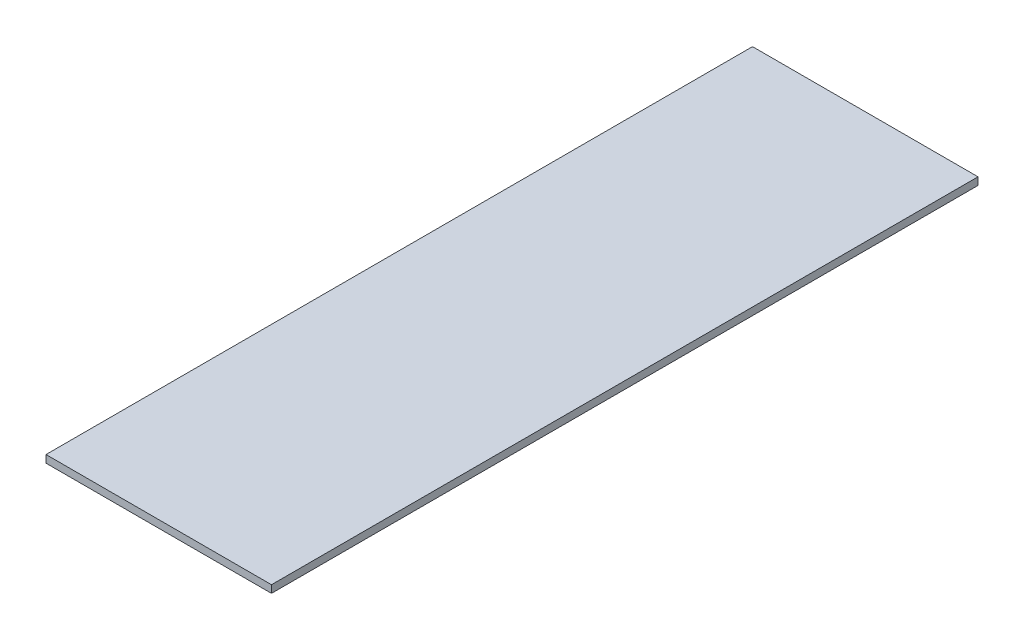
ISO-10303-21;
HEADER;
FILE_DESCRIPTION(('STEP AP214'),'2;1');
FILE_NAME('part.step','',(''),(''),'','','');
FILE_SCHEMA(('AUTOMOTIVE_DESIGN { 1 0 10303 214 1 1 1 1 }'));
ENDSEC;
DATA;
#1=APPLICATION_CONTEXT('core data for automotive mechanical design processes');
#2=APPLICATION_PROTOCOL_DEFINITION('international standard','automotive_design',2000,#1);
#3=PRODUCT_CONTEXT('',#1,'mechanical');
#4=PRODUCT('Part','Part','',(#3));
#5=PRODUCT_RELATED_PRODUCT_CATEGORY('part','',(#4));
#6=PRODUCT_DEFINITION_FORMATION('','',#4);
#7=PRODUCT_DEFINITION_CONTEXT('part definition',#1,'design');
#8=PRODUCT_DEFINITION('design','',#6,#7);
#9=PRODUCT_DEFINITION_SHAPE('','',#8);
#10=(LENGTH_UNIT() NAMED_UNIT(*) SI_UNIT(.MILLI.,.METRE.));
#11=(NAMED_UNIT(*) PLANE_ANGLE_UNIT() SI_UNIT($,.RADIAN.));
#12=(NAMED_UNIT(*) SI_UNIT($,.STERADIAN.) SOLID_ANGLE_UNIT());
#13=UNCERTAINTY_MEASURE_WITH_UNIT(LENGTH_MEASURE(1.E-05),#10,'distance_accuracy_value','');
#14=(GEOMETRIC_REPRESENTATION_CONTEXT(3) GLOBAL_UNCERTAINTY_ASSIGNED_CONTEXT((#13)) GLOBAL_UNIT_ASSIGNED_CONTEXT((#10,
#11,#12)) REPRESENTATION_CONTEXT('',''));
#15=CARTESIAN_POINT('',(0.,0.,0.));
#16=DIRECTION('',(0.,0.,1.));
#17=DIRECTION('',(1.,0.,0.));
#18=AXIS2_PLACEMENT_3D('',#15,#16,#17);
#19=CARTESIAN_POINT('',(21.25,1.52,14.48));
#20=DIRECTION('',(0.,1.,0.));
#21=DIRECTION('',(0.,0.,1.));
#22=AXIS2_PLACEMENT_3D('',#19,#20,#21);
#23=PLANE('',#22);
#24=DIRECTION('',(0.,0.,1.));
#25=VECTOR('',#24,1.);
#26=CARTESIAN_POINT('',(20.5,1.52,12.13));
#27=LINE('',#26,#25);
#28=CARTESIAN_POINT('',(20.5,1.52,12.13));
#29=VERTEX_POINT('',#28);
#30=CARTESIAN_POINT('',(20.5,1.52,16.83));
#31=VERTEX_POINT('',#30);
#32=EDGE_CURVE('E79',#29,#31,#27,.T.);
#33=ORIENTED_EDGE('',*,*,#32,.F.);
#34=DIRECTION('',(-1.,0.,0.));
#35=VECTOR('',#34,1.);
#36=CARTESIAN_POINT('',(22.,1.52,12.13));
#37=LINE('',#36,#35);
#38=CARTESIAN_POINT('',(22.,1.52,12.13));
#39=VERTEX_POINT('',#38);
#40=EDGE_CURVE('E55',#39,#29,#37,.T.);
#41=ORIENTED_EDGE('',*,*,#40,.F.);
#42=DIRECTION('',(0.,0.,-1.));
#43=VECTOR('',#42,1.);
#44=CARTESIAN_POINT('',(22.,1.52,16.83));
#45=LINE('',#44,#43);
#46=CARTESIAN_POINT('',(22.,1.52,16.83));
#47=VERTEX_POINT('',#46);
#48=EDGE_CURVE('E57',#47,#39,#45,.T.);
#49=ORIENTED_EDGE('',*,*,#48,.F.);
#50=DIRECTION('',(1.,0.,0.));
#51=VECTOR('',#50,1.);
#52=CARTESIAN_POINT('',(20.5,1.52,16.83));
#53=LINE('',#52,#51);
#54=EDGE_CURVE('E20',#31,#47,#53,.T.);
#55=ORIENTED_EDGE('',*,*,#54,.F.);
#56=EDGE_LOOP('',(#33,#41,#49,#55));
#57=FACE_BOUND('',#56,.T.);
#58=ADVANCED_FACE('F17',(#57),#23,.F.);
#59=CARTESIAN_POINT('',(20.5,1.52,16.83));
#60=DIRECTION('',(0.,0.,1.));
#61=DIRECTION('',(1.,0.,0.));
#62=AXIS2_PLACEMENT_3D('',#59,#60,#61);
#63=PLANE('',#62);
#64=DIRECTION('',(1.,0.,0.));
#65=VECTOR('',#64,1.);
#66=CARTESIAN_POINT('',(21.25,1.57,16.83));
#67=LINE('',#66,#65);
#68=CARTESIAN_POINT('',(20.5,1.57,16.83));
#69=VERTEX_POINT('',#68);
#70=CARTESIAN_POINT('',(22.,1.57,16.83));
#71=VERTEX_POINT('',#70);
#72=EDGE_CURVE('E83',#69,#71,#67,.T.);
#73=ORIENTED_EDGE('',*,*,#72,.F.);
#74=DIRECTION('',(0.,1.,0.));
#75=VECTOR('',#74,1.);
#76=CARTESIAN_POINT('',(20.5,1.52,16.83));
#77=LINE('',#76,#75);
#78=EDGE_CURVE('E68',#31,#69,#77,.T.);
#79=ORIENTED_EDGE('',*,*,#78,.F.);
#80=ORIENTED_EDGE('',*,*,#54,.T.);
#81=DIRECTION('',(0.,1.,0.));
#82=VECTOR('',#81,1.);
#83=CARTESIAN_POINT('',(22.,1.52,16.83));
#84=LINE('',#83,#82);
#85=EDGE_CURVE('E63',#71,#47,#84,.F.);
#86=ORIENTED_EDGE('',*,*,#85,.F.);
#87=EDGE_LOOP('',(#73,#79,#80,#86));
#88=FACE_BOUND('',#87,.T.);
#89=ADVANCED_FACE('F65',(#88),#63,.T.);
#90=CARTESIAN_POINT('',(22.,1.52,16.83));
#91=DIRECTION('',(1.,0.,0.));
#92=DIRECTION('',(0.,0.,-1.));
#93=AXIS2_PLACEMENT_3D('',#90,#91,#92);
#94=PLANE('',#93);
#95=DIRECTION('',(0.,0.,1.));
#96=VECTOR('',#95,1.);
#97=CARTESIAN_POINT('',(22.,1.57,14.48));
#98=LINE('',#97,#96);
#99=CARTESIAN_POINT('',(22.,1.57,12.13));
#100=VERTEX_POINT('',#99);
#101=EDGE_CURVE('E72',#71,#100,#98,.F.);
#102=ORIENTED_EDGE('',*,*,#101,.F.);
#103=ORIENTED_EDGE('',*,*,#85,.T.);
#104=ORIENTED_EDGE('',*,*,#48,.T.);
#105=DIRECTION('',(0.,1.,0.));
#106=VECTOR('',#105,1.);
#107=CARTESIAN_POINT('',(22.,1.52,12.13));
#108=LINE('',#107,#106);
#109=EDGE_CURVE('E75',#100,#39,#108,.F.);
#110=ORIENTED_EDGE('',*,*,#109,.F.);
#111=EDGE_LOOP('',(#102,#103,#104,#110));
#112=FACE_BOUND('',#111,.T.);
#113=ADVANCED_FACE('F70',(#112),#94,.T.);
#114=CARTESIAN_POINT('',(22.,1.52,12.13));
#115=DIRECTION('',(0.,0.,-1.));
#116=DIRECTION('',(-1.,0.,0.));
#117=AXIS2_PLACEMENT_3D('',#114,#115,#116);
#118=PLANE('',#117);
#119=DIRECTION('',(1.,0.,0.));
#120=VECTOR('',#119,1.);
#121=CARTESIAN_POINT('',(21.25,1.57,12.13));
#122=LINE('',#121,#120);
#123=CARTESIAN_POINT('',(20.5,1.57,12.13));
#124=VERTEX_POINT('',#123);
#125=EDGE_CURVE('E26',#100,#124,#122,.F.);
#126=ORIENTED_EDGE('',*,*,#125,.F.);
#127=ORIENTED_EDGE('',*,*,#109,.T.);
#128=ORIENTED_EDGE('',*,*,#40,.T.);
#129=DIRECTION('',(0.,1.,0.));
#130=VECTOR('',#129,1.);
#131=CARTESIAN_POINT('',(20.5,1.52,12.13));
#132=LINE('',#131,#130);
#133=EDGE_CURVE('E35',#124,#29,#132,.F.);
#134=ORIENTED_EDGE('',*,*,#133,.F.);
#135=EDGE_LOOP('',(#126,#127,#128,#134));
#136=FACE_BOUND('',#135,.T.);
#137=ADVANCED_FACE('F89',(#136),#118,.T.);
#138=CARTESIAN_POINT('',(20.5,1.52,12.13));
#139=DIRECTION('',(-1.,0.,0.));
#140=DIRECTION('',(0.,0.,1.));
#141=AXIS2_PLACEMENT_3D('',#138,#139,#140);
#142=PLANE('',#141);
#143=DIRECTION('',(0.,0.,1.));
#144=VECTOR('',#143,1.);
#145=CARTESIAN_POINT('',(20.5,1.57,14.48));
#146=LINE('',#145,#144);
#147=EDGE_CURVE('E11',#124,#69,#146,.T.);
#148=ORIENTED_EDGE('',*,*,#147,.F.);
#149=ORIENTED_EDGE('',*,*,#133,.T.);
#150=ORIENTED_EDGE('',*,*,#32,.T.);
#151=ORIENTED_EDGE('',*,*,#78,.T.);
#152=EDGE_LOOP('',(#148,#149,#150,#151));
#153=FACE_BOUND('',#152,.T.);
#154=ADVANCED_FACE('F91',(#153),#142,.T.);
#155=CARTESIAN_POINT('',(21.25,1.57,14.48));
#156=DIRECTION('',(0.,1.,0.));
#157=DIRECTION('',(0.,0.,1.));
#158=AXIS2_PLACEMENT_3D('',#155,#156,#157);
#159=PLANE('',#158);
#160=ORIENTED_EDGE('',*,*,#125,.T.);
#161=ORIENTED_EDGE('',*,*,#147,.T.);
#162=ORIENTED_EDGE('',*,*,#72,.T.);
#163=ORIENTED_EDGE('',*,*,#101,.T.);
#164=EDGE_LOOP('',(#160,#161,#162,#163));
#165=FACE_BOUND('',#164,.T.);
#166=ADVANCED_FACE('F88',(#165),#159,.T.);
#167=CLOSED_SHELL('',(#58,#89,#113,#137,#154,#166));
#168=MANIFOLD_SOLID_BREP('B1',#167);
#169=ADVANCED_BREP_SHAPE_REPRESENTATION('',(#18,#168),#14);
#170=SHAPE_DEFINITION_REPRESENTATION(#9,#169);
ENDSEC;
END-ISO-10303-21;
